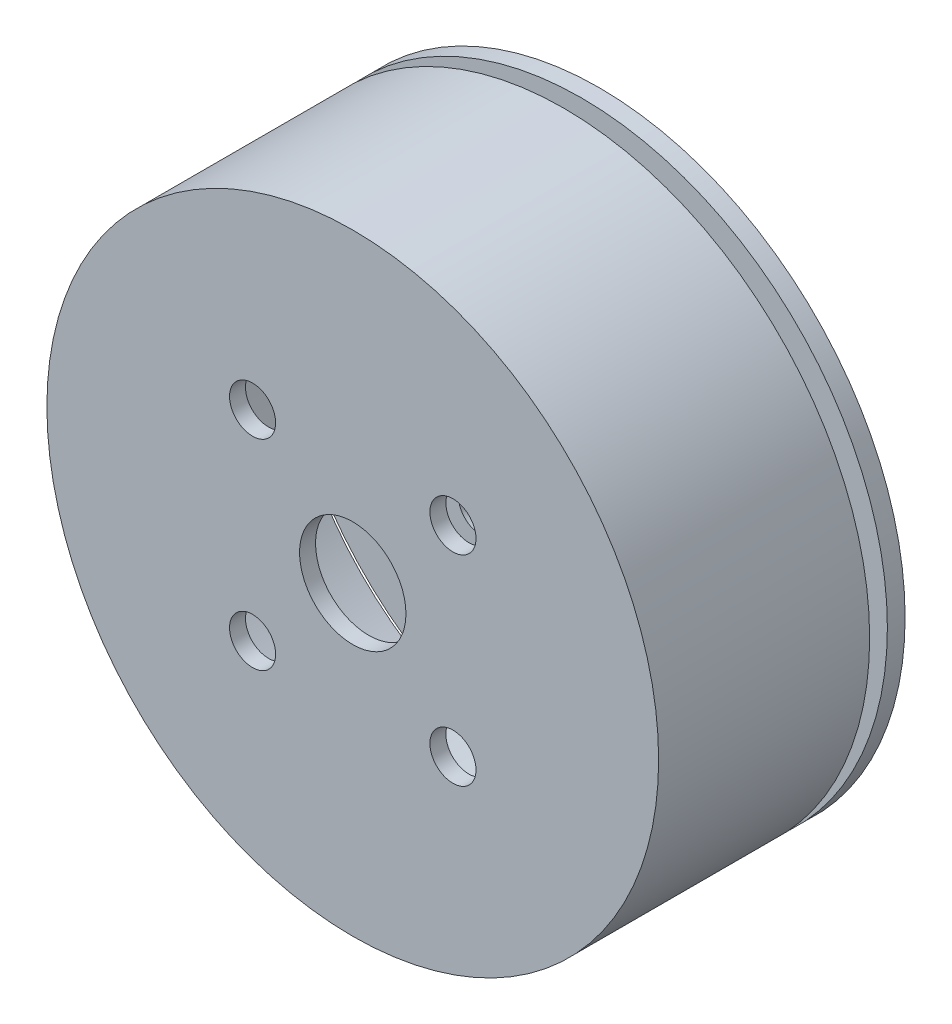
ISO-10303-21;
HEADER;
FILE_DESCRIPTION(('STEP AP214'),'2;1');
FILE_NAME('part.step','',(''),(''),'','','');
FILE_SCHEMA(('AUTOMOTIVE_DESIGN { 1 0 10303 214 1 1 1 1 }'));
ENDSEC;
DATA;
#1=APPLICATION_CONTEXT('core data for automotive mechanical design processes');
#2=APPLICATION_PROTOCOL_DEFINITION('international standard','automotive_design',2000,#1);
#3=PRODUCT_CONTEXT('',#1,'mechanical');
#4=PRODUCT('Part','Part','',(#3));
#5=PRODUCT_RELATED_PRODUCT_CATEGORY('part','',(#4));
#6=PRODUCT_DEFINITION_FORMATION('','',#4);
#7=PRODUCT_DEFINITION_CONTEXT('part definition',#1,'design');
#8=PRODUCT_DEFINITION('design','',#6,#7);
#9=PRODUCT_DEFINITION_SHAPE('','',#8);
#10=(LENGTH_UNIT() NAMED_UNIT(*) SI_UNIT(.MILLI.,.METRE.));
#11=(NAMED_UNIT(*) PLANE_ANGLE_UNIT() SI_UNIT($,.RADIAN.));
#12=(NAMED_UNIT(*) SI_UNIT($,.STERADIAN.) SOLID_ANGLE_UNIT());
#13=UNCERTAINTY_MEASURE_WITH_UNIT(LENGTH_MEASURE(1.E-05),#10,'distance_accuracy_value','');
#14=(GEOMETRIC_REPRESENTATION_CONTEXT(3) GLOBAL_UNCERTAINTY_ASSIGNED_CONTEXT((#13)) GLOBAL_UNIT_ASSIGNED_CONTEXT((#10,
#11,#12)) REPRESENTATION_CONTEXT('',''));
#15=CARTESIAN_POINT('',(0.,0.,0.));
#16=DIRECTION('',(0.,0.,1.));
#17=DIRECTION('',(1.,0.,0.));
#18=AXIS2_PLACEMENT_3D('',#15,#16,#17);
#19=CARTESIAN_POINT('',(0.,0.,13.9));
#20=DIRECTION('',(0.,0.,-1.));
#21=DIRECTION('',(-1.,0.,0.));
#22=AXIS2_PLACEMENT_3D('',#19,#20,#21);
#23=CYLINDRICAL_SURFACE('',#22,17.25);
#24=CARTESIAN_POINT('',(0.,0.,13.9));
#25=DIRECTION('',(0.,0.,1.));
#26=DIRECTION('',(1.,0.,0.));
#27=AXIS2_PLACEMENT_3D('',#24,#25,#26);
#28=CIRCLE('',#27,17.25);
#29=CARTESIAN_POINT('',(17.25,0.,13.9));
#30=VERTEX_POINT('',#29);
#31=EDGE_CURVE('E49',#30,#30,#28,.T.);
#32=ORIENTED_EDGE('',*,*,#31,.F.);
#33=EDGE_LOOP('',(#32));
#34=FACE_BOUND('',#33,.T.);
#35=CARTESIAN_POINT('',(0.,0.,2.));
#36=DIRECTION('',(0.,0.,-1.));
#37=DIRECTION('',(-1.,0.,0.));
#38=AXIS2_PLACEMENT_3D('',#35,#36,#37);
#39=CIRCLE('',#38,17.25);
#40=CARTESIAN_POINT('',(-17.25,0.,2.));
#41=VERTEX_POINT('',#40);
#42=EDGE_CURVE('E11',#41,#41,#39,.T.);
#43=ORIENTED_EDGE('',*,*,#42,.F.);
#44=EDGE_LOOP('',(#43));
#45=FACE_BOUND('',#44,.T.);
#46=ADVANCED_FACE('F42',(#34,#45),#23,.T.);
#47=CARTESIAN_POINT('',(0.,0.,13.9));
#48=DIRECTION('',(0.,0.,1.));
#49=DIRECTION('',(1.,0.,0.));
#50=AXIS2_PLACEMENT_3D('',#47,#48,#49);
#51=PLANE('',#50);
#52=CARTESIAN_POINT('',(0.,0.,13.9));
#53=DIRECTION('',(0.,0.,1.));
#54=DIRECTION('',(1.,0.,0.));
#55=AXIS2_PLACEMENT_3D('',#52,#53,#54);
#56=CIRCLE('',#55,3.);
#57=CARTESIAN_POINT('',(3.,0.,13.9));
#58=VERTEX_POINT('',#57);
#59=EDGE_CURVE('E84',#58,#58,#56,.T.);
#60=ORIENTED_EDGE('',*,*,#59,.F.);
#61=EDGE_LOOP('',(#60));
#62=FACE_BOUND('',#61,.T.);
#63=CARTESIAN_POINT('',(-5.65,5.65,13.9));
#64=DIRECTION('',(0.,0.,1.));
#65=DIRECTION('',(1.,0.,0.));
#66=AXIS2_PLACEMENT_3D('',#63,#64,#65);
#67=CIRCLE('',#66,1.3);
#68=CARTESIAN_POINT('',(-4.35,5.65,13.9));
#69=VERTEX_POINT('',#68);
#70=EDGE_CURVE('E87',#69,#69,#67,.T.);
#71=ORIENTED_EDGE('',*,*,#70,.F.);
#72=EDGE_LOOP('',(#71));
#73=FACE_BOUND('',#72,.T.);
#74=CARTESIAN_POINT('',(-5.65,-5.65,13.9));
#75=DIRECTION('',(0.,0.,1.));
#76=DIRECTION('',(1.,0.,0.));
#77=AXIS2_PLACEMENT_3D('',#74,#75,#76);
#78=CIRCLE('',#77,1.3);
#79=CARTESIAN_POINT('',(-4.35,-5.65,13.9));
#80=VERTEX_POINT('',#79);
#81=EDGE_CURVE('E90',#80,#80,#78,.T.);
#82=ORIENTED_EDGE('',*,*,#81,.F.);
#83=EDGE_LOOP('',(#82));
#84=FACE_BOUND('',#83,.T.);
#85=CARTESIAN_POINT('',(5.65,-5.65,13.9));
#86=DIRECTION('',(0.,0.,1.));
#87=DIRECTION('',(1.,0.,0.));
#88=AXIS2_PLACEMENT_3D('',#85,#86,#87);
#89=CIRCLE('',#88,1.3);
#90=CARTESIAN_POINT('',(6.95,-5.65,13.9));
#91=VERTEX_POINT('',#90);
#92=EDGE_CURVE('E83',#91,#91,#89,.T.);
#93=ORIENTED_EDGE('',*,*,#92,.F.);
#94=EDGE_LOOP('',(#93));
#95=FACE_BOUND('',#94,.T.);
#96=CARTESIAN_POINT('',(5.65,5.65,13.9));
#97=DIRECTION('',(0.,0.,1.));
#98=DIRECTION('',(1.,0.,0.));
#99=AXIS2_PLACEMENT_3D('',#96,#97,#98);
#100=CIRCLE('',#99,1.3);
#101=CARTESIAN_POINT('',(6.95,5.65,13.9));
#102=VERTEX_POINT('',#101);
#103=EDGE_CURVE('E62',#102,#102,#100,.T.);
#104=ORIENTED_EDGE('',*,*,#103,.F.);
#105=EDGE_LOOP('',(#104));
#106=FACE_BOUND('',#105,.T.);
#107=ORIENTED_EDGE('',*,*,#31,.T.);
#108=EDGE_LOOP('',(#107));
#109=FACE_BOUND('',#108,.T.);
#110=ADVANCED_FACE('F98',(#62,#73,#84,#95,#106,#109),#51,.T.);
#111=CARTESIAN_POINT('',(0.,0.,2.));
#112=DIRECTION('',(0.,0.,-1.));
#113=DIRECTION('',(-1.,0.,0.));
#114=AXIS2_PLACEMENT_3D('',#111,#112,#113);
#115=PLANE('',#114);
#116=CARTESIAN_POINT('',(0.,0.,2.));
#117=DIRECTION('',(0.,0.,-1.));
#118=DIRECTION('',(-1.,0.,0.));
#119=AXIS2_PLACEMENT_3D('',#116,#117,#118);
#120=CIRCLE('',#119,16.);
#121=CARTESIAN_POINT('',(-16.,0.,2.));
#122=VERTEX_POINT('',#121);
#123=EDGE_CURVE('E72',#122,#122,#120,.T.);
#124=ORIENTED_EDGE('',*,*,#123,.F.);
#125=EDGE_LOOP('',(#124));
#126=FACE_BOUND('',#125,.T.);
#127=ORIENTED_EDGE('',*,*,#42,.T.);
#128=EDGE_LOOP('',(#127));
#129=FACE_BOUND('',#128,.T.);
#130=ADVANCED_FACE('F101',(#126,#129),#115,.T.);
#131=CARTESIAN_POINT('',(0.,0.,13.));
#132=DIRECTION('',(0.,0.,-1.));
#133=DIRECTION('',(-1.,0.,0.));
#134=AXIS2_PLACEMENT_3D('',#131,#132,#133);
#135=CYLINDRICAL_SURFACE('',#134,16.);
#136=CARTESIAN_POINT('',(0.,0.,13.));
#137=DIRECTION('',(0.,0.,-1.));
#138=DIRECTION('',(-1.,0.,0.));
#139=AXIS2_PLACEMENT_3D('',#136,#137,#138);
#140=CIRCLE('',#139,16.);
#141=CARTESIAN_POINT('',(-16.,0.,13.));
#142=VERTEX_POINT('',#141);
#143=EDGE_CURVE('E54',#142,#142,#140,.T.);
#144=ORIENTED_EDGE('',*,*,#143,.F.);
#145=EDGE_LOOP('',(#144));
#146=FACE_BOUND('',#145,.T.);
#147=ORIENTED_EDGE('',*,*,#123,.T.);
#148=EDGE_LOOP('',(#147));
#149=FACE_BOUND('',#148,.T.);
#150=ADVANCED_FACE('F124',(#146,#149),#135,.F.);
#151=CARTESIAN_POINT('',(0.,0.,13.));
#152=DIRECTION('',(0.,0.,-1.));
#153=DIRECTION('',(-1.,0.,0.));
#154=AXIS2_PLACEMENT_3D('',#151,#152,#153);
#155=PLANE('',#154);
#156=CARTESIAN_POINT('',(0.,0.,13.));
#157=DIRECTION('',(0.,0.,-1.));
#158=DIRECTION('',(-1.,0.,0.));
#159=AXIS2_PLACEMENT_3D('',#156,#157,#158);
#160=CIRCLE('',#159,3.);
#161=CARTESIAN_POINT('',(-3.,0.,13.));
#162=VERTEX_POINT('',#161);
#163=EDGE_CURVE('E45',#162,#162,#160,.T.);
#164=ORIENTED_EDGE('',*,*,#163,.F.);
#165=EDGE_LOOP('',(#164));
#166=FACE_BOUND('',#165,.T.);
#167=CARTESIAN_POINT('',(-5.65,5.65,13.));
#168=DIRECTION('',(0.,0.,-1.));
#169=DIRECTION('',(-1.,0.,0.));
#170=AXIS2_PLACEMENT_3D('',#167,#168,#169);
#171=CIRCLE('',#170,1.3);
#172=CARTESIAN_POINT('',(-6.95,5.65,13.));
#173=VERTEX_POINT('',#172);
#174=EDGE_CURVE('E67',#173,#173,#171,.T.);
#175=ORIENTED_EDGE('',*,*,#174,.F.);
#176=EDGE_LOOP('',(#175));
#177=FACE_BOUND('',#176,.T.);
#178=CARTESIAN_POINT('',(-5.65,-5.65,13.));
#179=DIRECTION('',(0.,0.,-1.));
#180=DIRECTION('',(-1.,0.,0.));
#181=AXIS2_PLACEMENT_3D('',#178,#179,#180);
#182=CIRCLE('',#181,1.3);
#183=CARTESIAN_POINT('',(-6.95,-5.65,13.));
#184=VERTEX_POINT('',#183);
#185=EDGE_CURVE('E65',#184,#184,#182,.T.);
#186=ORIENTED_EDGE('',*,*,#185,.F.);
#187=EDGE_LOOP('',(#186));
#188=FACE_BOUND('',#187,.T.);
#189=CARTESIAN_POINT('',(5.65,-5.65,13.));
#190=DIRECTION('',(0.,0.,-1.));
#191=DIRECTION('',(-1.,0.,0.));
#192=AXIS2_PLACEMENT_3D('',#189,#190,#191);
#193=CIRCLE('',#192,1.3);
#194=CARTESIAN_POINT('',(4.35,-5.65,13.));
#195=VERTEX_POINT('',#194);
#196=EDGE_CURVE('E61',#195,#195,#193,.T.);
#197=ORIENTED_EDGE('',*,*,#196,.F.);
#198=EDGE_LOOP('',(#197));
#199=FACE_BOUND('',#198,.T.);
#200=CARTESIAN_POINT('',(5.65,5.65,13.));
#201=DIRECTION('',(0.,0.,-1.));
#202=DIRECTION('',(-1.,0.,0.));
#203=AXIS2_PLACEMENT_3D('',#200,#201,#202);
#204=CIRCLE('',#203,1.3);
#205=CARTESIAN_POINT('',(4.35,5.65,13.));
#206=VERTEX_POINT('',#205);
#207=EDGE_CURVE('E58',#206,#206,#204,.T.);
#208=ORIENTED_EDGE('',*,*,#207,.F.);
#209=EDGE_LOOP('',(#208));
#210=FACE_BOUND('',#209,.T.);
#211=ORIENTED_EDGE('',*,*,#143,.T.);
#212=EDGE_LOOP('',(#211));
#213=FACE_BOUND('',#212,.T.);
#214=ADVANCED_FACE('F130',(#166,#177,#188,#199,#210,#213),#155,.T.);
#215=CARTESIAN_POINT('',(5.65,5.65,-1.1));
#216=DIRECTION('',(0.,0.,1.));
#217=DIRECTION('',(1.,0.,0.));
#218=AXIS2_PLACEMENT_3D('',#215,#216,#217);
#219=CYLINDRICAL_SURFACE('',#218,1.3);
#220=ORIENTED_EDGE('',*,*,#207,.T.);
#221=EDGE_LOOP('',(#220));
#222=FACE_BOUND('',#221,.T.);
#223=ORIENTED_EDGE('',*,*,#103,.T.);
#224=EDGE_LOOP('',(#223));
#225=FACE_BOUND('',#224,.T.);
#226=ADVANCED_FACE('F137',(#222,#225),#219,.F.);
#227=CARTESIAN_POINT('',(5.65,-5.65,-1.1));
#228=DIRECTION('',(0.,0.,1.));
#229=DIRECTION('',(1.,0.,0.));
#230=AXIS2_PLACEMENT_3D('',#227,#228,#229);
#231=CYLINDRICAL_SURFACE('',#230,1.3);
#232=ORIENTED_EDGE('',*,*,#196,.T.);
#233=EDGE_LOOP('',(#232));
#234=FACE_BOUND('',#233,.T.);
#235=ORIENTED_EDGE('',*,*,#92,.T.);
#236=EDGE_LOOP('',(#235));
#237=FACE_BOUND('',#236,.T.);
#238=ADVANCED_FACE('F96',(#234,#237),#231,.F.);
#239=CARTESIAN_POINT('',(-5.65,-5.65,-1.1));
#240=DIRECTION('',(0.,0.,1.));
#241=DIRECTION('',(1.,0.,0.));
#242=AXIS2_PLACEMENT_3D('',#239,#240,#241);
#243=CYLINDRICAL_SURFACE('',#242,1.3);
#244=ORIENTED_EDGE('',*,*,#185,.T.);
#245=EDGE_LOOP('',(#244));
#246=FACE_BOUND('',#245,.T.);
#247=ORIENTED_EDGE('',*,*,#81,.T.);
#248=EDGE_LOOP('',(#247));
#249=FACE_BOUND('',#248,.T.);
#250=ADVANCED_FACE('F152',(#246,#249),#243,.F.);
#251=CARTESIAN_POINT('',(-5.65,5.65,-1.1));
#252=DIRECTION('',(0.,0.,1.));
#253=DIRECTION('',(1.,0.,0.));
#254=AXIS2_PLACEMENT_3D('',#251,#252,#253);
#255=CYLINDRICAL_SURFACE('',#254,1.3);
#256=ORIENTED_EDGE('',*,*,#174,.T.);
#257=EDGE_LOOP('',(#256));
#258=FACE_BOUND('',#257,.T.);
#259=ORIENTED_EDGE('',*,*,#70,.T.);
#260=EDGE_LOOP('',(#259));
#261=FACE_BOUND('',#260,.T.);
#262=ADVANCED_FACE('F160',(#258,#261),#255,.F.);
#263=CARTESIAN_POINT('',(0.,0.,-1.1));
#264=DIRECTION('',(0.,0.,1.));
#265=DIRECTION('',(1.,0.,0.));
#266=AXIS2_PLACEMENT_3D('',#263,#264,#265);
#267=CYLINDRICAL_SURFACE('',#266,3.);
#268=ORIENTED_EDGE('',*,*,#163,.T.);
#269=EDGE_LOOP('',(#268));
#270=FACE_BOUND('',#269,.T.);
#271=ORIENTED_EDGE('',*,*,#59,.T.);
#272=EDGE_LOOP('',(#271));
#273=FACE_BOUND('',#272,.T.);
#274=ADVANCED_FACE('F168',(#270,#273),#267,.F.);
#275=CLOSED_SHELL('',(#46,#110,#130,#150,#214,#226,#238,#250,#262,#274));
#276=MANIFOLD_SOLID_BREP('B2',#275);
#277=CARTESIAN_POINT('',(0.,0.,0.));
#278=DIRECTION('',(0.,0.,1.));
#279=DIRECTION('',(1.,0.,0.));
#280=AXIS2_PLACEMENT_3D('',#277,#278,#279);
#281=PLANE('',#280);
#282=CARTESIAN_POINT('',(5.65,5.65,0.));
#283=DIRECTION('',(0.,0.,-1.));
#284=DIRECTION('',(-1.,0.,0.));
#285=AXIS2_PLACEMENT_3D('',#282,#283,#284);
#286=CIRCLE('',#285,1.3);
#287=CARTESIAN_POINT('',(4.35,5.65,0.));
#288=VERTEX_POINT('',#287);
#289=EDGE_CURVE('E237',#288,#288,#286,.T.);
#290=ORIENTED_EDGE('',*,*,#289,.F.);
#291=EDGE_LOOP('',(#290));
#292=FACE_BOUND('',#291,.T.);
#293=CARTESIAN_POINT('',(-5.65,5.65,0.));
#294=DIRECTION('',(0.,0.,-1.));
#295=DIRECTION('',(-1.,0.,0.));
#296=AXIS2_PLACEMENT_3D('',#293,#294,#295);
#297=CIRCLE('',#296,1.3);
#298=CARTESIAN_POINT('',(-6.95,5.65,0.));
#299=VERTEX_POINT('',#298);
#300=EDGE_CURVE('E301',#299,#299,#297,.T.);
#301=ORIENTED_EDGE('',*,*,#300,.F.);
#302=EDGE_LOOP('',(#301));
#303=FACE_BOUND('',#302,.T.);
#304=CARTESIAN_POINT('',(-5.65,-5.65,0.));
#305=DIRECTION('',(0.,0.,-1.));
#306=DIRECTION('',(-1.,0.,0.));
#307=AXIS2_PLACEMENT_3D('',#304,#305,#306);
#308=CIRCLE('',#307,1.3);
#309=CARTESIAN_POINT('',(-6.95,-5.65,0.));
#310=VERTEX_POINT('',#309);
#311=EDGE_CURVE('E289',#310,#310,#308,.T.);
#312=ORIENTED_EDGE('',*,*,#311,.F.);
#313=EDGE_LOOP('',(#312));
#314=FACE_BOUND('',#313,.T.);
#315=CARTESIAN_POINT('',(5.65,-5.65,0.));
#316=DIRECTION('',(0.,0.,-1.));
#317=DIRECTION('',(-1.,0.,0.));
#318=AXIS2_PLACEMENT_3D('',#315,#316,#317);
#319=CIRCLE('',#318,1.3);
#320=CARTESIAN_POINT('',(4.35,-5.65,0.));
#321=VERTEX_POINT('',#320);
#322=EDGE_CURVE('E302',#321,#321,#319,.T.);
#323=ORIENTED_EDGE('',*,*,#322,.F.);
#324=EDGE_LOOP('',(#323));
#325=FACE_BOUND('',#324,.T.);
#326=CARTESIAN_POINT('',(0.,0.,0.));
#327=DIRECTION('',(0.,0.,-1.));
#328=DIRECTION('',(-1.,0.,0.));
#329=AXIS2_PLACEMENT_3D('',#326,#327,#328);
#330=CIRCLE('',#329,3.);
#331=CARTESIAN_POINT('',(-3.,0.,0.));
#332=VERTEX_POINT('',#331);
#333=EDGE_CURVE('E307',#332,#332,#330,.T.);
#334=ORIENTED_EDGE('',*,*,#333,.F.);
#335=EDGE_LOOP('',(#334));
#336=FACE_BOUND('',#335,.T.);
#337=CARTESIAN_POINT('',(0.,0.,0.));
#338=DIRECTION('',(0.,0.,1.));
#339=DIRECTION('',(1.,0.,0.));
#340=AXIS2_PLACEMENT_3D('',#337,#338,#339);
#341=CIRCLE('',#340,17.25);
#342=CARTESIAN_POINT('',(17.25,0.,0.));
#343=VERTEX_POINT('',#342);
#344=EDGE_CURVE('E41',#343,#343,#341,.T.);
#345=ORIENTED_EDGE('',*,*,#344,.F.);
#346=EDGE_LOOP('',(#345));
#347=FACE_BOUND('',#346,.T.);
#348=ADVANCED_FACE('F217',(#292,#303,#314,#325,#336,#347),#281,.F.);
#349=CARTESIAN_POINT('',(0.,0.,13.9));
#350=DIRECTION('',(0.,0.,-1.));
#351=DIRECTION('',(-1.,0.,0.));
#352=AXIS2_PLACEMENT_3D('',#349,#350,#351);
#353=CYLINDRICAL_SURFACE('',#352,17.25);
#354=CARTESIAN_POINT('',(0.,0.,1.));
#355=DIRECTION('',(0.,0.,-1.));
#356=DIRECTION('',(-1.,0.,0.));
#357=AXIS2_PLACEMENT_3D('',#354,#355,#356);
#358=CIRCLE('',#357,17.25);
#359=CARTESIAN_POINT('',(-17.25,0.,1.));
#360=VERTEX_POINT('',#359);
#361=EDGE_CURVE('E225',#360,#360,#358,.T.);
#362=ORIENTED_EDGE('',*,*,#361,.T.);
#363=EDGE_LOOP('',(#362));
#364=FACE_BOUND('',#363,.T.);
#365=ORIENTED_EDGE('',*,*,#344,.T.);
#366=EDGE_LOOP('',(#365));
#367=FACE_BOUND('',#366,.T.);
#368=ADVANCED_FACE('F219',(#364,#367),#353,.T.);
#369=CARTESIAN_POINT('',(0.,0.,1.));
#370=DIRECTION('',(0.,0.,-1.));
#371=DIRECTION('',(-1.,0.,0.));
#372=AXIS2_PLACEMENT_3D('',#369,#370,#371);
#373=PLANE('',#372);
#374=CARTESIAN_POINT('',(5.65,5.65,0.999999999999999));
#375=DIRECTION('',(0.,0.,-1.));
#376=DIRECTION('',(-1.,0.,0.));
#377=AXIS2_PLACEMENT_3D('',#374,#375,#376);
#378=CIRCLE('',#377,1.3);
#379=CARTESIAN_POINT('',(4.35,5.65,0.999999999999999));
#380=VERTEX_POINT('',#379);
#381=EDGE_CURVE('E221',#380,#380,#378,.T.);
#382=ORIENTED_EDGE('',*,*,#381,.T.);
#383=EDGE_LOOP('',(#382));
#384=FACE_BOUND('',#383,.T.);
#385=CARTESIAN_POINT('',(-5.65,5.65,0.999999999999999));
#386=DIRECTION('',(0.,0.,-1.));
#387=DIRECTION('',(-1.,0.,0.));
#388=AXIS2_PLACEMENT_3D('',#385,#386,#387);
#389=CIRCLE('',#388,1.3);
#390=CARTESIAN_POINT('',(-6.95,5.65,0.999999999999999));
#391=VERTEX_POINT('',#390);
#392=EDGE_CURVE('E242',#391,#391,#389,.T.);
#393=ORIENTED_EDGE('',*,*,#392,.T.);
#394=EDGE_LOOP('',(#393));
#395=FACE_BOUND('',#394,.T.);
#396=CARTESIAN_POINT('',(-5.65,-5.65,0.999999999999999));
#397=DIRECTION('',(0.,0.,-1.));
#398=DIRECTION('',(-1.,0.,0.));
#399=AXIS2_PLACEMENT_3D('',#396,#397,#398);
#400=CIRCLE('',#399,1.3);
#401=CARTESIAN_POINT('',(-6.95,-5.65,0.999999999999999));
#402=VERTEX_POINT('',#401);
#403=EDGE_CURVE('E240',#402,#402,#400,.T.);
#404=ORIENTED_EDGE('',*,*,#403,.T.);
#405=EDGE_LOOP('',(#404));
#406=FACE_BOUND('',#405,.T.);
#407=CARTESIAN_POINT('',(5.65,-5.65,0.999999999999999));
#408=DIRECTION('',(0.,0.,-1.));
#409=DIRECTION('',(-1.,0.,0.));
#410=AXIS2_PLACEMENT_3D('',#407,#408,#409);
#411=CIRCLE('',#410,1.3);
#412=CARTESIAN_POINT('',(4.35,-5.65,0.999999999999999));
#413=VERTEX_POINT('',#412);
#414=EDGE_CURVE('E236',#413,#413,#411,.T.);
#415=ORIENTED_EDGE('',*,*,#414,.T.);
#416=EDGE_LOOP('',(#415));
#417=FACE_BOUND('',#416,.T.);
#418=CARTESIAN_POINT('',(0.,0.,0.999999999999999));
#419=DIRECTION('',(0.,0.,-1.));
#420=DIRECTION('',(-1.,0.,0.));
#421=AXIS2_PLACEMENT_3D('',#418,#419,#420);
#422=CIRCLE('',#421,3.);
#423=CARTESIAN_POINT('',(-3.,0.,0.999999999999999));
#424=VERTEX_POINT('',#423);
#425=EDGE_CURVE('E233',#424,#424,#422,.T.);
#426=ORIENTED_EDGE('',*,*,#425,.T.);
#427=EDGE_LOOP('',(#426));
#428=FACE_BOUND('',#427,.T.);
#429=ORIENTED_EDGE('',*,*,#361,.F.);
#430=EDGE_LOOP('',(#429));
#431=FACE_BOUND('',#430,.T.);
#432=ADVANCED_FACE('F249',(#384,#395,#406,#417,#428,#431),#373,.F.);
#433=CARTESIAN_POINT('',(0.,0.,10.));
#434=DIRECTION('',(0.,0.,-1.));
#435=DIRECTION('',(-1.,0.,0.));
#436=AXIS2_PLACEMENT_3D('',#433,#434,#435);
#437=CYLINDRICAL_SURFACE('',#436,3.);
#438=ORIENTED_EDGE('',*,*,#333,.T.);
#439=EDGE_LOOP('',(#438));
#440=FACE_BOUND('',#439,.T.);
#441=ORIENTED_EDGE('',*,*,#425,.F.);
#442=EDGE_LOOP('',(#441));
#443=FACE_BOUND('',#442,.T.);
#444=ADVANCED_FACE('F274',(#440,#443),#437,.F.);
#445=CARTESIAN_POINT('',(5.65,-5.65,10.));
#446=DIRECTION('',(0.,0.,-1.));
#447=DIRECTION('',(-1.,0.,0.));
#448=AXIS2_PLACEMENT_3D('',#445,#446,#447);
#449=CYLINDRICAL_SURFACE('',#448,1.3);
#450=ORIENTED_EDGE('',*,*,#322,.T.);
#451=EDGE_LOOP('',(#450));
#452=FACE_BOUND('',#451,.T.);
#453=ORIENTED_EDGE('',*,*,#414,.F.);
#454=EDGE_LOOP('',(#453));
#455=FACE_BOUND('',#454,.T.);
#456=ADVANCED_FACE('F277',(#452,#455),#449,.F.);
#457=CARTESIAN_POINT('',(-5.65,-5.65,10.));
#458=DIRECTION('',(0.,0.,-1.));
#459=DIRECTION('',(-1.,0.,0.));
#460=AXIS2_PLACEMENT_3D('',#457,#458,#459);
#461=CYLINDRICAL_SURFACE('',#460,1.3);
#462=ORIENTED_EDGE('',*,*,#311,.T.);
#463=EDGE_LOOP('',(#462));
#464=FACE_BOUND('',#463,.T.);
#465=ORIENTED_EDGE('',*,*,#403,.F.);
#466=EDGE_LOOP('',(#465));
#467=FACE_BOUND('',#466,.T.);
#468=ADVANCED_FACE('F259',(#464,#467),#461,.F.);
#469=CARTESIAN_POINT('',(-5.65,5.65,10.));
#470=DIRECTION('',(0.,0.,-1.));
#471=DIRECTION('',(-1.,0.,0.));
#472=AXIS2_PLACEMENT_3D('',#469,#470,#471);
#473=CYLINDRICAL_SURFACE('',#472,1.3);
#474=ORIENTED_EDGE('',*,*,#300,.T.);
#475=EDGE_LOOP('',(#474));
#476=FACE_BOUND('',#475,.T.);
#477=ORIENTED_EDGE('',*,*,#392,.F.);
#478=EDGE_LOOP('',(#477));
#479=FACE_BOUND('',#478,.T.);
#480=ADVANCED_FACE('F253',(#476,#479),#473,.F.);
#481=CARTESIAN_POINT('',(5.65,5.65,10.));
#482=DIRECTION('',(0.,0.,-1.));
#483=DIRECTION('',(-1.,0.,0.));
#484=AXIS2_PLACEMENT_3D('',#481,#482,#483);
#485=CYLINDRICAL_SURFACE('',#484,1.3);
#486=ORIENTED_EDGE('',*,*,#289,.T.);
#487=EDGE_LOOP('',(#486));
#488=FACE_BOUND('',#487,.T.);
#489=ORIENTED_EDGE('',*,*,#381,.F.);
#490=EDGE_LOOP('',(#489));
#491=FACE_BOUND('',#490,.T.);
#492=ADVANCED_FACE('F251',(#488,#491),#485,.F.);
#493=CLOSED_SHELL('',(#348,#368,#432,#444,#456,#468,#480,#492));
#494=MANIFOLD_SOLID_BREP('B6',#493);
#495=ADVANCED_BREP_SHAPE_REPRESENTATION('',(#18,#276,#494),#14);
#496=SHAPE_DEFINITION_REPRESENTATION(#9,#495);
ENDSEC;
END-ISO-10303-21;
